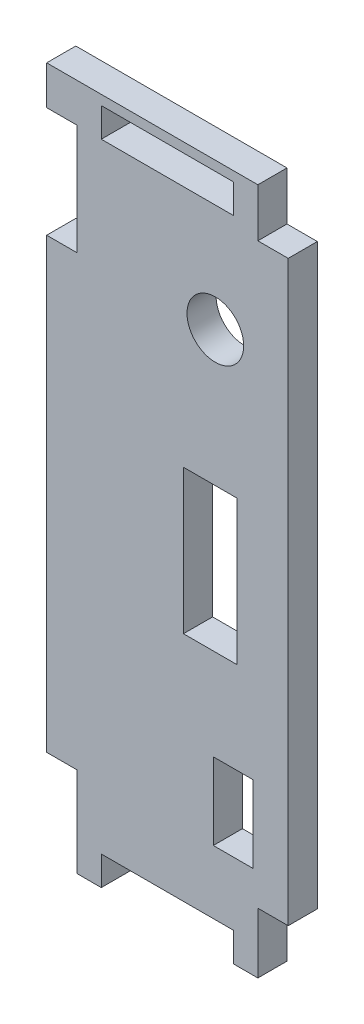
ISO-10303-21;
HEADER;
FILE_DESCRIPTION(('STEP AP214'),'2;1');
FILE_NAME('part.step','',(''),(''),'','','');
FILE_SCHEMA(('AUTOMOTIVE_DESIGN { 1 0 10303 214 1 1 1 1 }'));
ENDSEC;
DATA;
#1=APPLICATION_CONTEXT('core data for automotive mechanical design processes');
#2=APPLICATION_PROTOCOL_DEFINITION('international standard','automotive_design',2000,#1);
#3=PRODUCT_CONTEXT('',#1,'mechanical');
#4=PRODUCT('Part','Part','',(#3));
#5=PRODUCT_RELATED_PRODUCT_CATEGORY('part','',(#4));
#6=PRODUCT_DEFINITION_FORMATION('','',#4);
#7=PRODUCT_DEFINITION_CONTEXT('part definition',#1,'design');
#8=PRODUCT_DEFINITION('design','',#6,#7);
#9=PRODUCT_DEFINITION_SHAPE('','',#8);
#10=(LENGTH_UNIT() NAMED_UNIT(*) SI_UNIT(.MILLI.,.METRE.));
#11=(NAMED_UNIT(*) PLANE_ANGLE_UNIT() SI_UNIT($,.RADIAN.));
#12=(NAMED_UNIT(*) SI_UNIT($,.STERADIAN.) SOLID_ANGLE_UNIT());
#13=UNCERTAINTY_MEASURE_WITH_UNIT(LENGTH_MEASURE(1.E-05),#10,'distance_accuracy_value','');
#14=(GEOMETRIC_REPRESENTATION_CONTEXT(3) GLOBAL_UNCERTAINTY_ASSIGNED_CONTEXT((#13)) GLOBAL_UNIT_ASSIGNED_CONTEXT((#10,
#11,#12)) REPRESENTATION_CONTEXT('',''));
#15=CARTESIAN_POINT('',(0.,0.,0.));
#16=DIRECTION('',(0.,0.,1.));
#17=DIRECTION('',(1.,0.,0.));
#18=AXIS2_PLACEMENT_3D('',#15,#16,#17);
#19=CARTESIAN_POINT('',(19.558,0.,3.048));
#20=DIRECTION('',(-1.,0.,0.));
#21=DIRECTION('',(0.,0.,1.));
#22=AXIS2_PLACEMENT_3D('',#19,#20,#21);
#23=PLANE('',#22);
#24=DIRECTION('',(0.,1.,0.));
#25=VECTOR('',#24,1.);
#26=CARTESIAN_POINT('',(19.558,0.,0.));
#27=LINE('',#26,#25);
#28=CARTESIAN_POINT('',(19.558,64.77,0.));
#29=VERTEX_POINT('',#28);
#30=CARTESIAN_POINT('',(19.558,67.818,0.));
#31=VERTEX_POINT('',#30);
#32=EDGE_CURVE('E336',#29,#31,#27,.T.);
#33=ORIENTED_EDGE('',*,*,#32,.F.);
#34=DIRECTION('',(0.,0.,-1.));
#35=VECTOR('',#34,1.);
#36=CARTESIAN_POINT('',(19.558,64.77,3.048));
#37=LINE('',#36,#35);
#38=CARTESIAN_POINT('',(19.558,64.77,3.048));
#39=VERTEX_POINT('',#38);
#40=EDGE_CURVE('E11',#39,#29,#37,.T.);
#41=ORIENTED_EDGE('',*,*,#40,.F.);
#42=DIRECTION('',(0.,1.,0.));
#43=VECTOR('',#42,1.);
#44=CARTESIAN_POINT('',(19.558,0.,3.048));
#45=LINE('',#44,#43);
#46=CARTESIAN_POINT('',(19.558,67.818,3.048));
#47=VERTEX_POINT('',#46);
#48=EDGE_CURVE('E258',#39,#47,#45,.T.);
#49=ORIENTED_EDGE('',*,*,#48,.T.);
#50=DIRECTION('',(0.,0.,-1.));
#51=VECTOR('',#50,1.);
#52=CARTESIAN_POINT('',(19.558,67.818,3.048));
#53=LINE('',#52,#51);
#54=EDGE_CURVE('E153',#47,#31,#53,.T.);
#55=ORIENTED_EDGE('',*,*,#54,.T.);
#56=EDGE_LOOP('',(#33,#41,#49,#55));
#57=FACE_BOUND('',#56,.T.);
#58=ADVANCED_FACE('F33',(#57),#23,.T.);
#59=CARTESIAN_POINT('',(0.,64.77,3.048));
#60=DIRECTION('',(0.,1.,0.));
#61=DIRECTION('',(0.,0.,1.));
#62=AXIS2_PLACEMENT_3D('',#59,#60,#61);
#63=PLANE('',#62);
#64=DIRECTION('',(1.,0.,0.));
#65=VECTOR('',#64,1.);
#66=CARTESIAN_POINT('',(0.,64.77,0.));
#67=LINE('',#66,#65);
#68=CARTESIAN_POINT('',(5.71499999999999,64.77,0.));
#69=VERTEX_POINT('',#68);
#70=EDGE_CURVE('E248',#69,#29,#67,.T.);
#71=ORIENTED_EDGE('',*,*,#70,.F.);
#72=DIRECTION('',(0.,0.,-1.));
#73=VECTOR('',#72,1.);
#74=CARTESIAN_POINT('',(5.71499999999999,64.77,3.048));
#75=LINE('',#74,#73);
#76=CARTESIAN_POINT('',(5.71499999999999,64.77,3.048));
#77=VERTEX_POINT('',#76);
#78=EDGE_CURVE('E43',#77,#69,#75,.T.);
#79=ORIENTED_EDGE('',*,*,#78,.F.);
#80=DIRECTION('',(1.,0.,0.));
#81=VECTOR('',#80,1.);
#82=CARTESIAN_POINT('',(0.,64.77,3.048));
#83=LINE('',#82,#81);
#84=EDGE_CURVE('E246',#77,#39,#83,.T.);
#85=ORIENTED_EDGE('',*,*,#84,.T.);
#86=ORIENTED_EDGE('',*,*,#40,.T.);
#87=EDGE_LOOP('',(#71,#79,#85,#86));
#88=FACE_BOUND('',#87,.T.);
#89=ADVANCED_FACE('F244',(#88),#63,.T.);
#90=CARTESIAN_POINT('',(5.71499999999983,0.,3.048));
#91=DIRECTION('',(-1.,0.,0.));
#92=DIRECTION('',(0.,-1.,0.));
#93=AXIS2_PLACEMENT_3D('',#90,#91,#92);
#94=PLANE('',#93);
#95=DIRECTION('',(0.,1.,0.));
#96=VECTOR('',#95,1.);
#97=CARTESIAN_POINT('',(5.71499999999983,0.,0.));
#98=LINE('',#97,#96);
#99=CARTESIAN_POINT('',(5.715,67.818,0.));
#100=VERTEX_POINT('',#99);
#101=EDGE_CURVE('E339',#69,#100,#98,.T.);
#102=ORIENTED_EDGE('',*,*,#101,.T.);
#103=DIRECTION('',(0.,0.,-1.));
#104=VECTOR('',#103,1.);
#105=CARTESIAN_POINT('',(5.715,67.818,3.048));
#106=LINE('',#105,#104);
#107=CARTESIAN_POINT('',(5.715,67.818,3.048));
#108=VERTEX_POINT('',#107);
#109=EDGE_CURVE('E251',#108,#100,#106,.T.);
#110=ORIENTED_EDGE('',*,*,#109,.F.);
#111=DIRECTION('',(0.,1.,0.));
#112=VECTOR('',#111,1.);
#113=CARTESIAN_POINT('',(5.71499999999983,0.,3.048));
#114=LINE('',#113,#112);
#115=EDGE_CURVE('E254',#77,#108,#114,.T.);
#116=ORIENTED_EDGE('',*,*,#115,.F.);
#117=ORIENTED_EDGE('',*,*,#78,.T.);
#118=EDGE_LOOP('',(#102,#110,#116,#117));
#119=FACE_BOUND('',#118,.T.);
#120=ADVANCED_FACE('F255',(#119),#94,.F.);
#121=CARTESIAN_POINT('',(0.,6.62939999999999,3.048));
#122=DIRECTION('',(0.,1.,0.));
#123=DIRECTION('',(0.,0.,1.));
#124=AXIS2_PLACEMENT_3D('',#121,#122,#123);
#125=PLANE('',#124);
#126=DIRECTION('',(1.,0.,0.));
#127=VECTOR('',#126,1.);
#128=CARTESIAN_POINT('',(0.,6.62939999999999,0.));
#129=LINE('',#128,#127);
#130=CARTESIAN_POINT('',(17.4370999999999,6.62939999999999,0.));
#131=VERTEX_POINT('',#130);
#132=CARTESIAN_POINT('',(21.6153999999999,6.62939999999999,0.));
#133=VERTEX_POINT('',#132);
#134=EDGE_CURVE('E324',#131,#133,#129,.T.);
#135=ORIENTED_EDGE('',*,*,#134,.F.);
#136=DIRECTION('',(0.,0.,-1.));
#137=VECTOR('',#136,1.);
#138=CARTESIAN_POINT('',(17.4370999999999,6.62939999999999,3.048));
#139=LINE('',#138,#137);
#140=CARTESIAN_POINT('',(17.4370999999999,6.62939999999999,3.048));
#141=VERTEX_POINT('',#140);
#142=EDGE_CURVE('E344',#141,#131,#139,.T.);
#143=ORIENTED_EDGE('',*,*,#142,.F.);
#144=DIRECTION('',(1.,0.,0.));
#145=VECTOR('',#144,1.);
#146=CARTESIAN_POINT('',(0.,6.62939999999999,3.048));
#147=LINE('',#146,#145);
#148=CARTESIAN_POINT('',(21.6153999999999,6.62939999999999,3.048));
#149=VERTEX_POINT('',#148);
#150=EDGE_CURVE('E480',#141,#149,#147,.T.);
#151=ORIENTED_EDGE('',*,*,#150,.T.);
#152=DIRECTION('',(0.,0.,-1.));
#153=VECTOR('',#152,1.);
#154=CARTESIAN_POINT('',(21.6153999999999,6.62939999999999,3.048));
#155=LINE('',#154,#153);
#156=EDGE_CURVE('E346',#149,#133,#155,.T.);
#157=ORIENTED_EDGE('',*,*,#156,.T.);
#158=EDGE_LOOP('',(#135,#143,#151,#157));
#159=FACE_BOUND('',#158,.T.);
#160=ADVANCED_FACE('F503',(#159),#125,.T.);
#161=CARTESIAN_POINT('',(17.4370999999999,0.,3.048));
#162=DIRECTION('',(-1.,0.,0.));
#163=DIRECTION('',(0.,-1.,0.));
#164=AXIS2_PLACEMENT_3D('',#161,#162,#163);
#165=PLANE('',#164);
#166=DIRECTION('',(0.,1.,0.));
#167=VECTOR('',#166,1.);
#168=CARTESIAN_POINT('',(17.4370999999999,0.,0.));
#169=LINE('',#168,#167);
#170=CARTESIAN_POINT('',(17.4370999999999,14.6685,0.));
#171=VERTEX_POINT('',#170);
#172=EDGE_CURVE('E327',#131,#171,#169,.T.);
#173=ORIENTED_EDGE('',*,*,#172,.T.);
#174=DIRECTION('',(0.,0.,-1.));
#175=VECTOR('',#174,1.);
#176=CARTESIAN_POINT('',(17.4370999999999,14.6685,3.048));
#177=LINE('',#176,#175);
#178=CARTESIAN_POINT('',(17.4370999999999,14.6685,3.048));
#179=VERTEX_POINT('',#178);
#180=EDGE_CURVE('E351',#179,#171,#177,.T.);
#181=ORIENTED_EDGE('',*,*,#180,.F.);
#182=DIRECTION('',(0.,1.,0.));
#183=VECTOR('',#182,1.);
#184=CARTESIAN_POINT('',(17.4370999999999,0.,3.048));
#185=LINE('',#184,#183);
#186=EDGE_CURVE('E483',#141,#179,#185,.T.);
#187=ORIENTED_EDGE('',*,*,#186,.F.);
#188=ORIENTED_EDGE('',*,*,#142,.T.);
#189=EDGE_LOOP('',(#173,#181,#187,#188));
#190=FACE_BOUND('',#189,.T.);
#191=ADVANCED_FACE('F505',(#190),#165,.F.);
#192=CARTESIAN_POINT('',(0.,14.6685,3.048));
#193=DIRECTION('',(0.,1.,0.));
#194=DIRECTION('',(-1.,0.,0.));
#195=AXIS2_PLACEMENT_3D('',#192,#193,#194);
#196=PLANE('',#195);
#197=DIRECTION('',(1.,0.,0.));
#198=VECTOR('',#197,1.);
#199=CARTESIAN_POINT('',(0.,14.6685,0.));
#200=LINE('',#199,#198);
#201=CARTESIAN_POINT('',(21.6153999999999,14.6685,0.));
#202=VERTEX_POINT('',#201);
#203=EDGE_CURVE('E330',#171,#202,#200,.T.);
#204=ORIENTED_EDGE('',*,*,#203,.T.);
#205=DIRECTION('',(0.,0.,-1.));
#206=VECTOR('',#205,1.);
#207=CARTESIAN_POINT('',(21.6153999999999,14.6685,3.048));
#208=LINE('',#207,#206);
#209=CARTESIAN_POINT('',(21.6153999999999,14.6685,3.048));
#210=VERTEX_POINT('',#209);
#211=EDGE_CURVE('E348',#210,#202,#208,.T.);
#212=ORIENTED_EDGE('',*,*,#211,.F.);
#213=DIRECTION('',(1.,0.,0.));
#214=VECTOR('',#213,1.);
#215=CARTESIAN_POINT('',(0.,14.6685,3.048));
#216=LINE('',#215,#214);
#217=EDGE_CURVE('E486',#179,#210,#216,.T.);
#218=ORIENTED_EDGE('',*,*,#217,.F.);
#219=ORIENTED_EDGE('',*,*,#180,.T.);
#220=EDGE_LOOP('',(#204,#212,#218,#219));
#221=FACE_BOUND('',#220,.T.);
#222=ADVANCED_FACE('F498',(#221),#196,.F.);
#223=CARTESIAN_POINT('',(1.46568363506623E-13,39.3446000000001,3.048));
#224=DIRECTION('',(0.,-1.,0.));
#225=DIRECTION('',(1.,0.,0.));
#226=AXIS2_PLACEMENT_3D('',#223,#224,#225);
#227=PLANE('',#226);
#228=DIRECTION('',(-1.,0.,0.));
#229=VECTOR('',#228,1.);
#230=CARTESIAN_POINT('',(1.46568363506623E-13,39.3446000000001,0.));
#231=LINE('',#230,#229);
#232=CARTESIAN_POINT('',(19.9009,39.3446,0.));
#233=VERTEX_POINT('',#232);
#234=CARTESIAN_POINT('',(14.3129,39.3446,0.));
#235=VERTEX_POINT('',#234);
#236=EDGE_CURVE('E312',#233,#235,#231,.T.);
#237=ORIENTED_EDGE('',*,*,#236,.F.);
#238=DIRECTION('',(0.,0.,-1.));
#239=VECTOR('',#238,1.);
#240=CARTESIAN_POINT('',(19.9009,39.3446,3.048));
#241=LINE('',#240,#239);
#242=CARTESIAN_POINT('',(19.9009,39.3446,3.048));
#243=VERTEX_POINT('',#242);
#244=EDGE_CURVE('E349',#243,#233,#241,.T.);
#245=ORIENTED_EDGE('',*,*,#244,.F.);
#246=DIRECTION('',(-1.,0.,0.));
#247=VECTOR('',#246,1.);
#248=CARTESIAN_POINT('',(1.46568363506623E-13,39.3446000000001,3.048));
#249=LINE('',#248,#247);
#250=CARTESIAN_POINT('',(14.3129,39.3446,3.048));
#251=VERTEX_POINT('',#250);
#252=EDGE_CURVE('E469',#243,#251,#249,.T.);
#253=ORIENTED_EDGE('',*,*,#252,.T.);
#254=DIRECTION('',(0.,0.,-1.));
#255=VECTOR('',#254,1.);
#256=CARTESIAN_POINT('',(14.3129,39.3446,3.048));
#257=LINE('',#256,#255);
#258=EDGE_CURVE('E355',#251,#235,#257,.T.);
#259=ORIENTED_EDGE('',*,*,#258,.T.);
#260=EDGE_LOOP('',(#237,#245,#253,#259));
#261=FACE_BOUND('',#260,.T.);
#262=ADVANCED_FACE('F512',(#261),#227,.T.);
#263=CARTESIAN_POINT('',(19.9008999999999,0.,3.048));
#264=DIRECTION('',(-1.,0.,0.));
#265=DIRECTION('',(0.,-1.,0.));
#266=AXIS2_PLACEMENT_3D('',#263,#264,#265);
#267=PLANE('',#266);
#268=DIRECTION('',(0.,1.,0.));
#269=VECTOR('',#268,1.);
#270=CARTESIAN_POINT('',(19.9008999999999,0.,0.));
#271=LINE('',#270,#269);
#272=CARTESIAN_POINT('',(19.9009,24.257,0.));
#273=VERTEX_POINT('',#272);
#274=EDGE_CURVE('E315',#273,#233,#271,.T.);
#275=ORIENTED_EDGE('',*,*,#274,.F.);
#276=DIRECTION('',(0.,0.,-1.));
#277=VECTOR('',#276,1.);
#278=CARTESIAN_POINT('',(19.9009,24.257,3.048));
#279=LINE('',#278,#277);
#280=CARTESIAN_POINT('',(19.9009,24.257,3.048));
#281=VERTEX_POINT('',#280);
#282=EDGE_CURVE('E360',#281,#273,#279,.T.);
#283=ORIENTED_EDGE('',*,*,#282,.F.);
#284=DIRECTION('',(0.,1.,0.));
#285=VECTOR('',#284,1.);
#286=CARTESIAN_POINT('',(19.9008999999999,0.,3.048));
#287=LINE('',#286,#285);
#288=EDGE_CURVE('E472',#281,#243,#287,.T.);
#289=ORIENTED_EDGE('',*,*,#288,.T.);
#290=ORIENTED_EDGE('',*,*,#244,.T.);
#291=EDGE_LOOP('',(#275,#283,#289,#290));
#292=FACE_BOUND('',#291,.T.);
#293=ADVANCED_FACE('F600',(#292),#267,.T.);
#294=CARTESIAN_POINT('',(0.,24.257,3.048));
#295=DIRECTION('',(0.,-1.,0.));
#296=DIRECTION('',(1.,0.,0.));
#297=AXIS2_PLACEMENT_3D('',#294,#295,#296);
#298=PLANE('',#297);
#299=DIRECTION('',(-1.,0.,0.));
#300=VECTOR('',#299,1.);
#301=CARTESIAN_POINT('',(0.,24.257,0.));
#302=LINE('',#301,#300);
#303=CARTESIAN_POINT('',(14.3129,24.257,0.));
#304=VERTEX_POINT('',#303);
#305=EDGE_CURVE('E318',#273,#304,#302,.T.);
#306=ORIENTED_EDGE('',*,*,#305,.T.);
#307=DIRECTION('',(0.,0.,-1.));
#308=VECTOR('',#307,1.);
#309=CARTESIAN_POINT('',(14.3129,24.257,3.048));
#310=LINE('',#309,#308);
#311=CARTESIAN_POINT('',(14.3129,24.257,3.048));
#312=VERTEX_POINT('',#311);
#313=EDGE_CURVE('E357',#312,#304,#310,.T.);
#314=ORIENTED_EDGE('',*,*,#313,.F.);
#315=DIRECTION('',(-1.,0.,0.));
#316=VECTOR('',#315,1.);
#317=CARTESIAN_POINT('',(0.,24.257,3.048));
#318=LINE('',#317,#316);
#319=EDGE_CURVE('E475',#281,#312,#318,.T.);
#320=ORIENTED_EDGE('',*,*,#319,.F.);
#321=ORIENTED_EDGE('',*,*,#282,.T.);
#322=EDGE_LOOP('',(#306,#314,#320,#321));
#323=FACE_BOUND('',#322,.T.);
#324=ADVANCED_FACE('F596',(#323),#298,.F.);
#325=CARTESIAN_POINT('',(0.,63.754,3.048));
#326=DIRECTION('',(0.,-1.,0.));
#327=DIRECTION('',(0.,0.,-1.));
#328=AXIS2_PLACEMENT_3D('',#325,#326,#327);
#329=PLANE('',#328);
#330=DIRECTION('',(-1.,0.,0.));
#331=VECTOR('',#330,1.);
#332=CARTESIAN_POINT('',(0.,63.754,0.));
#333=LINE('',#332,#331);
#334=CARTESIAN_POINT('',(25.273,63.754,0.));
#335=VERTEX_POINT('',#334);
#336=CARTESIAN_POINT('',(22.098,63.754,0.));
#337=VERTEX_POINT('',#336);
#338=EDGE_CURVE('E266',#335,#337,#333,.T.);
#339=ORIENTED_EDGE('',*,*,#338,.T.);
#340=DIRECTION('',(0.,0.,-1.));
#341=VECTOR('',#340,1.);
#342=CARTESIAN_POINT('',(22.098,63.754,3.048));
#343=LINE('',#342,#341);
#344=CARTESIAN_POINT('',(22.098,63.754,3.048));
#345=VERTEX_POINT('',#344);
#346=EDGE_CURVE('E37',#345,#337,#343,.T.);
#347=ORIENTED_EDGE('',*,*,#346,.F.);
#348=DIRECTION('',(-1.,0.,0.));
#349=VECTOR('',#348,1.);
#350=CARTESIAN_POINT('',(0.,63.754,3.048));
#351=LINE('',#350,#349);
#352=CARTESIAN_POINT('',(25.273,63.754,3.048));
#353=VERTEX_POINT('',#352);
#354=EDGE_CURVE('E342',#353,#345,#351,.T.);
#355=ORIENTED_EDGE('',*,*,#354,.F.);
#356=DIRECTION('',(0.,0.,-1.));
#357=VECTOR('',#356,1.);
#358=CARTESIAN_POINT('',(25.273,63.754,3.048));
#359=LINE('',#358,#357);
#360=EDGE_CURVE('E265',#353,#335,#359,.T.);
#361=ORIENTED_EDGE('',*,*,#360,.T.);
#362=EDGE_LOOP('',(#339,#347,#355,#361));
#363=FACE_BOUND('',#362,.T.);
#364=ADVANCED_FACE('F35',(#363),#329,.F.);
#365=CARTESIAN_POINT('',(22.098,0.,3.048));
#366=DIRECTION('',(-1.,0.,0.));
#367=DIRECTION('',(0.,0.,1.));
#368=AXIS2_PLACEMENT_3D('',#365,#366,#367);
#369=PLANE('',#368);
#370=DIRECTION('',(0.,1.,0.));
#371=VECTOR('',#370,1.);
#372=CARTESIAN_POINT('',(22.098,0.,0.));
#373=LINE('',#372,#371);
#374=CARTESIAN_POINT('',(22.098,68.834,0.));
#375=VERTEX_POINT('',#374);
#376=EDGE_CURVE('E269',#337,#375,#373,.T.);
#377=ORIENTED_EDGE('',*,*,#376,.T.);
#378=DIRECTION('',(0.,0.,-1.));
#379=VECTOR('',#378,1.);
#380=CARTESIAN_POINT('',(22.098,68.834,3.048));
#381=LINE('',#380,#379);
#382=CARTESIAN_POINT('',(22.098,68.834,3.048));
#383=VERTEX_POINT('',#382);
#384=EDGE_CURVE('E403',#383,#375,#381,.T.);
#385=ORIENTED_EDGE('',*,*,#384,.F.);
#386=DIRECTION('',(0.,1.,0.));
#387=VECTOR('',#386,1.);
#388=CARTESIAN_POINT('',(22.098,0.,3.048));
#389=LINE('',#388,#387);
#390=EDGE_CURVE('E161',#345,#383,#389,.T.);
#391=ORIENTED_EDGE('',*,*,#390,.F.);
#392=ORIENTED_EDGE('',*,*,#346,.T.);
#393=EDGE_LOOP('',(#377,#385,#391,#392));
#394=FACE_BOUND('',#393,.T.);
#395=ADVANCED_FACE('F409',(#394),#369,.F.);
#396=CARTESIAN_POINT('',(0.,68.834,3.048));
#397=DIRECTION('',(0.,-1.,0.));
#398=DIRECTION('',(0.,0.,-1.));
#399=AXIS2_PLACEMENT_3D('',#396,#397,#398);
#400=PLANE('',#399);
#401=DIRECTION('',(-1.,0.,0.));
#402=VECTOR('',#401,1.);
#403=CARTESIAN_POINT('',(0.,68.834,0.));
#404=LINE('',#403,#402);
#405=CARTESIAN_POINT('',(0.,68.834,0.));
#406=VERTEX_POINT('',#405);
#407=EDGE_CURVE('E271',#375,#406,#404,.T.);
#408=ORIENTED_EDGE('',*,*,#407,.T.);
#409=DIRECTION('',(0.,0.,-1.));
#410=VECTOR('',#409,1.);
#411=CARTESIAN_POINT('',(0.,68.834,3.048));
#412=LINE('',#411,#410);
#413=CARTESIAN_POINT('',(0.,68.834,3.048));
#414=VERTEX_POINT('',#413);
#415=EDGE_CURVE('E401',#414,#406,#412,.T.);
#416=ORIENTED_EDGE('',*,*,#415,.F.);
#417=DIRECTION('',(-1.,0.,0.));
#418=VECTOR('',#417,1.);
#419=CARTESIAN_POINT('',(0.,68.834,3.048));
#420=LINE('',#419,#418);
#421=EDGE_CURVE('E431',#383,#414,#420,.T.);
#422=ORIENTED_EDGE('',*,*,#421,.F.);
#423=ORIENTED_EDGE('',*,*,#384,.T.);
#424=EDGE_LOOP('',(#408,#416,#422,#423));
#425=FACE_BOUND('',#424,.T.);
#426=ADVANCED_FACE('F422',(#425),#400,.F.);
#427=CARTESIAN_POINT('',(0.,0.,3.048));
#428=DIRECTION('',(1.,0.,0.));
#429=DIRECTION('',(0.,1.,0.));
#430=AXIS2_PLACEMENT_3D('',#427,#428,#429);
#431=PLANE('',#430);
#432=DIRECTION('',(0.,-1.,0.));
#433=VECTOR('',#432,1.);
#434=CARTESIAN_POINT('',(0.,0.,0.));
#435=LINE('',#434,#433);
#436=CARTESIAN_POINT('',(0.,64.77,0.));
#437=VERTEX_POINT('',#436);
#438=EDGE_CURVE('E273',#406,#437,#435,.T.);
#439=ORIENTED_EDGE('',*,*,#438,.T.);
#440=DIRECTION('',(0.,0.,-1.));
#441=VECTOR('',#440,1.);
#442=CARTESIAN_POINT('',(0.,64.77,3.048));
#443=LINE('',#442,#441);
#444=CARTESIAN_POINT('',(0.,64.77,3.048));
#445=VERTEX_POINT('',#444);
#446=EDGE_CURVE('E398',#445,#437,#443,.T.);
#447=ORIENTED_EDGE('',*,*,#446,.F.);
#448=DIRECTION('',(0.,-1.,0.));
#449=VECTOR('',#448,1.);
#450=CARTESIAN_POINT('',(0.,0.,3.048));
#451=LINE('',#450,#449);
#452=EDGE_CURVE('E427',#414,#445,#451,.T.);
#453=ORIENTED_EDGE('',*,*,#452,.F.);
#454=ORIENTED_EDGE('',*,*,#415,.T.);
#455=EDGE_LOOP('',(#439,#447,#453,#454));
#456=FACE_BOUND('',#455,.T.);
#457=ADVANCED_FACE('F425',(#456),#431,.F.);
#458=CARTESIAN_POINT('',(0.,64.77,3.048));
#459=DIRECTION('',(0.,1.,0.));
#460=DIRECTION('',(0.,0.,1.));
#461=AXIS2_PLACEMENT_3D('',#458,#459,#460);
#462=PLANE('',#461);
#463=DIRECTION('',(1.,0.,0.));
#464=VECTOR('',#463,1.);
#465=CARTESIAN_POINT('',(0.,64.77,0.));
#466=LINE('',#465,#464);
#467=CARTESIAN_POINT('',(3.17499999999999,64.77,0.));
#468=VERTEX_POINT('',#467);
#469=EDGE_CURVE('E275',#437,#468,#466,.T.);
#470=ORIENTED_EDGE('',*,*,#469,.T.);
#471=DIRECTION('',(0.,0.,-1.));
#472=VECTOR('',#471,1.);
#473=CARTESIAN_POINT('',(3.17499999999999,64.77,3.048));
#474=LINE('',#473,#472);
#475=CARTESIAN_POINT('',(3.17499999999999,64.77,3.048));
#476=VERTEX_POINT('',#475);
#477=EDGE_CURVE('E395',#476,#468,#474,.T.);
#478=ORIENTED_EDGE('',*,*,#477,.F.);
#479=DIRECTION('',(1.,0.,0.));
#480=VECTOR('',#479,1.);
#481=CARTESIAN_POINT('',(0.,64.77,3.048));
#482=LINE('',#481,#480);
#483=EDGE_CURVE('E430',#445,#476,#482,.T.);
#484=ORIENTED_EDGE('',*,*,#483,.F.);
#485=ORIENTED_EDGE('',*,*,#446,.T.);
#486=EDGE_LOOP('',(#470,#478,#484,#485));
#487=FACE_BOUND('',#486,.T.);
#488=ADVANCED_FACE('F584',(#487),#462,.F.);
#489=CARTESIAN_POINT('',(3.17500000000003,0.,3.048));
#490=DIRECTION('',(1.,0.,0.));
#491=DIRECTION('',(0.,1.,0.));
#492=AXIS2_PLACEMENT_3D('',#489,#490,#491);
#493=PLANE('',#492);
#494=DIRECTION('',(0.,-1.,0.));
#495=VECTOR('',#494,1.);
#496=CARTESIAN_POINT('',(3.17500000000003,0.,0.));
#497=LINE('',#496,#495);
#498=CARTESIAN_POINT('',(3.175,53.213,0.));
#499=VERTEX_POINT('',#498);
#500=EDGE_CURVE('E277',#468,#499,#497,.T.);
#501=ORIENTED_EDGE('',*,*,#500,.T.);
#502=DIRECTION('',(0.,0.,-1.));
#503=VECTOR('',#502,1.);
#504=CARTESIAN_POINT('',(3.175,53.213,3.048));
#505=LINE('',#504,#503);
#506=CARTESIAN_POINT('',(3.175,53.213,3.048));
#507=VERTEX_POINT('',#506);
#508=EDGE_CURVE('E392',#507,#499,#505,.T.);
#509=ORIENTED_EDGE('',*,*,#508,.F.);
#510=DIRECTION('',(0.,-1.,0.));
#511=VECTOR('',#510,1.);
#512=CARTESIAN_POINT('',(3.17500000000003,0.,3.048));
#513=LINE('',#512,#511);
#514=EDGE_CURVE('E433',#476,#507,#513,.T.);
#515=ORIENTED_EDGE('',*,*,#514,.F.);
#516=ORIENTED_EDGE('',*,*,#477,.T.);
#517=EDGE_LOOP('',(#501,#509,#515,#516));
#518=FACE_BOUND('',#517,.T.);
#519=ADVANCED_FACE('F580',(#518),#493,.F.);
#520=CARTESIAN_POINT('',(0.,53.213,3.048));
#521=DIRECTION('',(0.,-1.,0.));
#522=DIRECTION('',(0.,0.,-1.));
#523=AXIS2_PLACEMENT_3D('',#520,#521,#522);
#524=PLANE('',#523);
#525=DIRECTION('',(-1.,0.,0.));
#526=VECTOR('',#525,1.);
#527=CARTESIAN_POINT('',(0.,53.213,0.));
#528=LINE('',#527,#526);
#529=CARTESIAN_POINT('',(0.,53.213,0.));
#530=VERTEX_POINT('',#529);
#531=EDGE_CURVE('E279',#499,#530,#528,.T.);
#532=ORIENTED_EDGE('',*,*,#531,.T.);
#533=DIRECTION('',(0.,0.,-1.));
#534=VECTOR('',#533,1.);
#535=CARTESIAN_POINT('',(0.,53.213,3.048));
#536=LINE('',#535,#534);
#537=CARTESIAN_POINT('',(0.,53.213,3.048));
#538=VERTEX_POINT('',#537);
#539=EDGE_CURVE('E389',#538,#530,#536,.T.);
#540=ORIENTED_EDGE('',*,*,#539,.F.);
#541=DIRECTION('',(-1.,0.,0.));
#542=VECTOR('',#541,1.);
#543=CARTESIAN_POINT('',(0.,53.213,3.048));
#544=LINE('',#543,#542);
#545=EDGE_CURVE('E439',#507,#538,#544,.T.);
#546=ORIENTED_EDGE('',*,*,#545,.F.);
#547=ORIENTED_EDGE('',*,*,#508,.T.);
#548=EDGE_LOOP('',(#532,#540,#546,#547));
#549=FACE_BOUND('',#548,.T.);
#550=ADVANCED_FACE('F576',(#549),#524,.F.);
#551=CARTESIAN_POINT('',(0.,0.,3.048));
#552=DIRECTION('',(1.,0.,0.));
#553=DIRECTION('',(0.,0.,-1.));
#554=AXIS2_PLACEMENT_3D('',#551,#552,#553);
#555=PLANE('',#554);
#556=DIRECTION('',(0.,-1.,0.));
#557=VECTOR('',#556,1.);
#558=CARTESIAN_POINT('',(0.,0.,0.));
#559=LINE('',#558,#557);
#560=CARTESIAN_POINT('',(0.,6.35,0.));
#561=VERTEX_POINT('',#560);
#562=EDGE_CURVE('E281',#530,#561,#559,.T.);
#563=ORIENTED_EDGE('',*,*,#562,.T.);
#564=DIRECTION('',(0.,0.,-1.));
#565=VECTOR('',#564,1.);
#566=CARTESIAN_POINT('',(0.,6.35,3.048));
#567=LINE('',#566,#565);
#568=CARTESIAN_POINT('',(0.,6.35,3.048));
#569=VERTEX_POINT('',#568);
#570=EDGE_CURVE('E387',#569,#561,#567,.T.);
#571=ORIENTED_EDGE('',*,*,#570,.F.);
#572=DIRECTION('',(0.,-1.,0.));
#573=VECTOR('',#572,1.);
#574=CARTESIAN_POINT('',(0.,0.,3.048));
#575=LINE('',#574,#573);
#576=EDGE_CURVE('E441',#538,#569,#575,.T.);
#577=ORIENTED_EDGE('',*,*,#576,.F.);
#578=ORIENTED_EDGE('',*,*,#539,.T.);
#579=EDGE_LOOP('',(#563,#571,#577,#578));
#580=FACE_BOUND('',#579,.T.);
#581=ADVANCED_FACE('F572',(#580),#555,.F.);
#582=CARTESIAN_POINT('',(0.,6.35,3.048));
#583=DIRECTION('',(0.,-1.,0.));
#584=DIRECTION('',(0.,0.,-1.));
#585=AXIS2_PLACEMENT_3D('',#582,#583,#584);
#586=PLANE('',#585);
#587=DIRECTION('',(-1.,0.,0.));
#588=VECTOR('',#587,1.);
#589=CARTESIAN_POINT('',(0.,6.35,0.));
#590=LINE('',#589,#588);
#591=CARTESIAN_POINT('',(3.175,6.35,0.));
#592=VERTEX_POINT('',#591);
#593=EDGE_CURVE('E284',#592,#561,#590,.T.);
#594=ORIENTED_EDGE('',*,*,#593,.F.);
#595=DIRECTION('',(0.,0.,-1.));
#596=VECTOR('',#595,1.);
#597=CARTESIAN_POINT('',(3.175,6.35,3.048));
#598=LINE('',#597,#596);
#599=CARTESIAN_POINT('',(3.175,6.35,3.048));
#600=VERTEX_POINT('',#599);
#601=EDGE_CURVE('E385',#600,#592,#598,.T.);
#602=ORIENTED_EDGE('',*,*,#601,.F.);
#603=DIRECTION('',(-1.,0.,0.));
#604=VECTOR('',#603,1.);
#605=CARTESIAN_POINT('',(0.,6.35,3.048));
#606=LINE('',#605,#604);
#607=EDGE_CURVE('E443',#600,#569,#606,.T.);
#608=ORIENTED_EDGE('',*,*,#607,.T.);
#609=ORIENTED_EDGE('',*,*,#570,.T.);
#610=EDGE_LOOP('',(#594,#602,#608,#609));
#611=FACE_BOUND('',#610,.T.);
#612=ADVANCED_FACE('F568',(#611),#586,.T.);
#613=CARTESIAN_POINT('',(3.175,0.,3.048));
#614=DIRECTION('',(1.,0.,0.));
#615=DIRECTION('',(0.,0.,-1.));
#616=AXIS2_PLACEMENT_3D('',#613,#614,#615);
#617=PLANE('',#616);
#618=DIRECTION('',(0.,-1.,0.));
#619=VECTOR('',#618,1.);
#620=CARTESIAN_POINT('',(3.175,0.,0.));
#621=LINE('',#620,#619);
#622=CARTESIAN_POINT('',(3.175,-3.048,0.));
#623=VERTEX_POINT('',#622);
#624=EDGE_CURVE('E287',#592,#623,#621,.T.);
#625=ORIENTED_EDGE('',*,*,#624,.T.);
#626=DIRECTION('',(0.,0.,-1.));
#627=VECTOR('',#626,1.);
#628=CARTESIAN_POINT('',(3.175,-3.048,3.048));
#629=LINE('',#628,#627);
#630=CARTESIAN_POINT('',(3.175,-3.048,3.048));
#631=VERTEX_POINT('',#630);
#632=EDGE_CURVE('E383',#631,#623,#629,.T.);
#633=ORIENTED_EDGE('',*,*,#632,.F.);
#634=DIRECTION('',(0.,-1.,0.));
#635=VECTOR('',#634,1.);
#636=CARTESIAN_POINT('',(3.175,0.,3.048));
#637=LINE('',#636,#635);
#638=EDGE_CURVE('E446',#600,#631,#637,.T.);
#639=ORIENTED_EDGE('',*,*,#638,.F.);
#640=ORIENTED_EDGE('',*,*,#601,.T.);
#641=EDGE_LOOP('',(#625,#633,#639,#640));
#642=FACE_BOUND('',#641,.T.);
#643=ADVANCED_FACE('F564',(#642),#617,.F.);
#644=CARTESIAN_POINT('',(0.,-3.048,3.048));
#645=DIRECTION('',(0.,-1.,0.));
#646=DIRECTION('',(1.,0.,0.));
#647=AXIS2_PLACEMENT_3D('',#644,#645,#646);
#648=PLANE('',#647);
#649=DIRECTION('',(-1.,0.,0.));
#650=VECTOR('',#649,1.);
#651=CARTESIAN_POINT('',(0.,-3.048,0.));
#652=LINE('',#651,#650);
#653=CARTESIAN_POINT('',(5.715,-3.048,0.));
#654=VERTEX_POINT('',#653);
#655=EDGE_CURVE('E290',#654,#623,#652,.T.);
#656=ORIENTED_EDGE('',*,*,#655,.F.);
#657=DIRECTION('',(0.,0.,-1.));
#658=VECTOR('',#657,1.);
#659=CARTESIAN_POINT('',(5.715,-3.048,3.048));
#660=LINE('',#659,#658);
#661=CARTESIAN_POINT('',(5.715,-3.048,3.048));
#662=VERTEX_POINT('',#661);
#663=EDGE_CURVE('E381',#662,#654,#660,.T.);
#664=ORIENTED_EDGE('',*,*,#663,.F.);
#665=DIRECTION('',(-1.,0.,0.));
#666=VECTOR('',#665,1.);
#667=CARTESIAN_POINT('',(0.,-3.048,3.048));
#668=LINE('',#667,#666);
#669=EDGE_CURVE('E448',#662,#631,#668,.T.);
#670=ORIENTED_EDGE('',*,*,#669,.T.);
#671=ORIENTED_EDGE('',*,*,#632,.T.);
#672=EDGE_LOOP('',(#656,#664,#670,#671));
#673=FACE_BOUND('',#672,.T.);
#674=ADVANCED_FACE('F560',(#673),#648,.T.);
#675=CARTESIAN_POINT('',(5.715,0.,3.048));
#676=DIRECTION('',(-1.,0.,0.));
#677=DIRECTION('',(0.,0.,1.));
#678=AXIS2_PLACEMENT_3D('',#675,#676,#677);
#679=PLANE('',#678);
#680=DIRECTION('',(0.,1.,0.));
#681=VECTOR('',#680,1.);
#682=CARTESIAN_POINT('',(5.715,0.,0.));
#683=LINE('',#682,#681);
#684=CARTESIAN_POINT('',(5.715,0.,0.));
#685=VERTEX_POINT('',#684);
#686=EDGE_CURVE('E293',#654,#685,#683,.T.);
#687=ORIENTED_EDGE('',*,*,#686,.T.);
#688=DIRECTION('',(0.,0.,-1.));
#689=VECTOR('',#688,1.);
#690=CARTESIAN_POINT('',(5.715,0.,3.048));
#691=LINE('',#690,#689);
#692=CARTESIAN_POINT('',(5.715,0.,3.048));
#693=VERTEX_POINT('',#692);
#694=EDGE_CURVE('E378',#693,#685,#691,.T.);
#695=ORIENTED_EDGE('',*,*,#694,.F.);
#696=DIRECTION('',(0.,1.,0.));
#697=VECTOR('',#696,1.);
#698=CARTESIAN_POINT('',(5.715,0.,3.048));
#699=LINE('',#698,#697);
#700=EDGE_CURVE('E451',#662,#693,#699,.T.);
#701=ORIENTED_EDGE('',*,*,#700,.F.);
#702=ORIENTED_EDGE('',*,*,#663,.T.);
#703=EDGE_LOOP('',(#687,#695,#701,#702));
#704=FACE_BOUND('',#703,.T.);
#705=ADVANCED_FACE('F556',(#704),#679,.F.);
#706=CARTESIAN_POINT('',(0.,0.,3.048));
#707=DIRECTION('',(0.,1.,0.));
#708=DIRECTION('',(0.,0.,1.));
#709=AXIS2_PLACEMENT_3D('',#706,#707,#708);
#710=PLANE('',#709);
#711=DIRECTION('',(1.,0.,0.));
#712=VECTOR('',#711,1.);
#713=CARTESIAN_POINT('',(0.,0.,0.));
#714=LINE('',#713,#712);
#715=CARTESIAN_POINT('',(19.558,0.,0.));
#716=VERTEX_POINT('',#715);
#717=EDGE_CURVE('E295',#685,#716,#714,.T.);
#718=ORIENTED_EDGE('',*,*,#717,.T.);
#719=DIRECTION('',(0.,0.,-1.));
#720=VECTOR('',#719,1.);
#721=CARTESIAN_POINT('',(19.558,0.,3.048));
#722=LINE('',#721,#720);
#723=CARTESIAN_POINT('',(19.558,0.,3.048));
#724=VERTEX_POINT('',#723);
#725=EDGE_CURVE('E375',#724,#716,#722,.T.);
#726=ORIENTED_EDGE('',*,*,#725,.F.);
#727=DIRECTION('',(1.,0.,0.));
#728=VECTOR('',#727,1.);
#729=CARTESIAN_POINT('',(0.,0.,3.048));
#730=LINE('',#729,#728);
#731=EDGE_CURVE('E453',#693,#724,#730,.T.);
#732=ORIENTED_EDGE('',*,*,#731,.F.);
#733=ORIENTED_EDGE('',*,*,#694,.T.);
#734=EDGE_LOOP('',(#718,#726,#732,#733));
#735=FACE_BOUND('',#734,.T.);
#736=ADVANCED_FACE('F552',(#735),#710,.F.);
#737=CARTESIAN_POINT('',(19.558,0.,3.048));
#738=DIRECTION('',(1.,0.,0.));
#739=DIRECTION('',(0.,0.,-1.));
#740=AXIS2_PLACEMENT_3D('',#737,#738,#739);
#741=PLANE('',#740);
#742=DIRECTION('',(0.,-1.,0.));
#743=VECTOR('',#742,1.);
#744=CARTESIAN_POINT('',(19.558,0.,0.));
#745=LINE('',#744,#743);
#746=CARTESIAN_POINT('',(19.558,-3.048,0.));
#747=VERTEX_POINT('',#746);
#748=EDGE_CURVE('E297',#716,#747,#745,.T.);
#749=ORIENTED_EDGE('',*,*,#748,.T.);
#750=DIRECTION('',(0.,0.,-1.));
#751=VECTOR('',#750,1.);
#752=CARTESIAN_POINT('',(19.558,-3.048,3.048));
#753=LINE('',#752,#751);
#754=CARTESIAN_POINT('',(19.558,-3.048,3.048));
#755=VERTEX_POINT('',#754);
#756=EDGE_CURVE('E373',#755,#747,#753,.T.);
#757=ORIENTED_EDGE('',*,*,#756,.F.);
#758=DIRECTION('',(0.,-1.,0.));
#759=VECTOR('',#758,1.);
#760=CARTESIAN_POINT('',(19.558,0.,3.048));
#761=LINE('',#760,#759);
#762=EDGE_CURVE('E455',#724,#755,#761,.T.);
#763=ORIENTED_EDGE('',*,*,#762,.F.);
#764=ORIENTED_EDGE('',*,*,#725,.T.);
#765=EDGE_LOOP('',(#749,#757,#763,#764));
#766=FACE_BOUND('',#765,.T.);
#767=ADVANCED_FACE('F548',(#766),#741,.F.);
#768=CARTESIAN_POINT('',(0.,-3.048,3.048));
#769=DIRECTION('',(0.,-1.,0.));
#770=DIRECTION('',(0.,0.,-1.));
#771=AXIS2_PLACEMENT_3D('',#768,#769,#770);
#772=PLANE('',#771);
#773=DIRECTION('',(-1.,0.,0.));
#774=VECTOR('',#773,1.);
#775=CARTESIAN_POINT('',(0.,-3.048,0.));
#776=LINE('',#775,#774);
#777=CARTESIAN_POINT('',(22.098,-3.048,0.));
#778=VERTEX_POINT('',#777);
#779=EDGE_CURVE('E300',#778,#747,#776,.T.);
#780=ORIENTED_EDGE('',*,*,#779,.F.);
#781=DIRECTION('',(0.,0.,-1.));
#782=VECTOR('',#781,1.);
#783=CARTESIAN_POINT('',(22.098,-3.048,3.048));
#784=LINE('',#783,#782);
#785=CARTESIAN_POINT('',(22.098,-3.048,3.048));
#786=VERTEX_POINT('',#785);
#787=EDGE_CURVE('E371',#786,#778,#784,.T.);
#788=ORIENTED_EDGE('',*,*,#787,.F.);
#789=DIRECTION('',(-1.,0.,0.));
#790=VECTOR('',#789,1.);
#791=CARTESIAN_POINT('',(0.,-3.048,3.048));
#792=LINE('',#791,#790);
#793=EDGE_CURVE('E457',#786,#755,#792,.T.);
#794=ORIENTED_EDGE('',*,*,#793,.T.);
#795=ORIENTED_EDGE('',*,*,#756,.T.);
#796=EDGE_LOOP('',(#780,#788,#794,#795));
#797=FACE_BOUND('',#796,.T.);
#798=ADVANCED_FACE('F539',(#797),#772,.T.);
#799=CARTESIAN_POINT('',(22.098,0.,3.048));
#800=DIRECTION('',(-1.,0.,0.));
#801=DIRECTION('',(0.,0.,1.));
#802=AXIS2_PLACEMENT_3D('',#799,#800,#801);
#803=PLANE('',#802);
#804=DIRECTION('',(0.,1.,0.));
#805=VECTOR('',#804,1.);
#806=CARTESIAN_POINT('',(22.098,0.,0.));
#807=LINE('',#806,#805);
#808=CARTESIAN_POINT('',(22.098,3.27660000000002,0.));
#809=VERTEX_POINT('',#808);
#810=EDGE_CURVE('E303',#778,#809,#807,.T.);
#811=ORIENTED_EDGE('',*,*,#810,.T.);
#812=DIRECTION('',(0.,0.,-1.));
#813=VECTOR('',#812,1.);
#814=CARTESIAN_POINT('',(22.098,3.27660000000002,3.048));
#815=LINE('',#814,#813);
#816=CARTESIAN_POINT('',(22.098,3.27660000000002,3.048));
#817=VERTEX_POINT('',#816);
#818=EDGE_CURVE('E368',#817,#809,#815,.T.);
#819=ORIENTED_EDGE('',*,*,#818,.F.);
#820=DIRECTION('',(0.,1.,0.));
#821=VECTOR('',#820,1.);
#822=CARTESIAN_POINT('',(22.098,0.,3.048));
#823=LINE('',#822,#821);
#824=EDGE_CURVE('E460',#786,#817,#823,.T.);
#825=ORIENTED_EDGE('',*,*,#824,.F.);
#826=ORIENTED_EDGE('',*,*,#787,.T.);
#827=EDGE_LOOP('',(#811,#819,#825,#826));
#828=FACE_BOUND('',#827,.T.);
#829=ADVANCED_FACE('F533',(#828),#803,.F.);
#830=CARTESIAN_POINT('',(0.,3.27660000000001,3.048));
#831=DIRECTION('',(0.,1.,0.));
#832=DIRECTION('',(-1.,0.,0.));
#833=AXIS2_PLACEMENT_3D('',#830,#831,#832);
#834=PLANE('',#833);
#835=DIRECTION('',(1.,0.,0.));
#836=VECTOR('',#835,1.);
#837=CARTESIAN_POINT('',(0.,3.27660000000001,0.));
#838=LINE('',#837,#836);
#839=CARTESIAN_POINT('',(25.273,3.27660000000002,0.));
#840=VERTEX_POINT('',#839);
#841=EDGE_CURVE('E305',#809,#840,#838,.T.);
#842=ORIENTED_EDGE('',*,*,#841,.T.);
#843=DIRECTION('',(0.,0.,-1.));
#844=VECTOR('',#843,1.);
#845=CARTESIAN_POINT('',(25.273,3.27660000000002,3.048));
#846=LINE('',#845,#844);
#847=CARTESIAN_POINT('',(25.273,3.27660000000002,3.048));
#848=VERTEX_POINT('',#847);
#849=EDGE_CURVE('E365',#848,#840,#846,.T.);
#850=ORIENTED_EDGE('',*,*,#849,.F.);
#851=DIRECTION('',(1.,0.,0.));
#852=VECTOR('',#851,1.);
#853=CARTESIAN_POINT('',(0.,3.27660000000001,3.048));
#854=LINE('',#853,#852);
#855=EDGE_CURVE('E462',#817,#848,#854,.T.);
#856=ORIENTED_EDGE('',*,*,#855,.F.);
#857=ORIENTED_EDGE('',*,*,#818,.T.);
#858=EDGE_LOOP('',(#842,#850,#856,#857));
#859=FACE_BOUND('',#858,.T.);
#860=ADVANCED_FACE('F525',(#859),#834,.F.);
#861=CARTESIAN_POINT('',(21.6153999999999,0.,3.048));
#862=DIRECTION('',(-1.,0.,0.));
#863=DIRECTION('',(0.,-1.,0.));
#864=AXIS2_PLACEMENT_3D('',#861,#862,#863);
#865=PLANE('',#864);
#866=DIRECTION('',(0.,1.,0.));
#867=VECTOR('',#866,1.);
#868=CARTESIAN_POINT('',(21.6153999999999,0.,0.));
#869=LINE('',#868,#867);
#870=EDGE_CURVE('E333',#133,#202,#869,.T.);
#871=ORIENTED_EDGE('',*,*,#870,.F.);
#872=ORIENTED_EDGE('',*,*,#156,.F.);
#873=DIRECTION('',(0.,1.,0.));
#874=VECTOR('',#873,1.);
#875=CARTESIAN_POINT('',(21.6153999999999,0.,3.048));
#876=LINE('',#875,#874);
#877=EDGE_CURVE('E260',#149,#210,#876,.T.);
#878=ORIENTED_EDGE('',*,*,#877,.T.);
#879=ORIENTED_EDGE('',*,*,#211,.T.);
#880=EDGE_LOOP('',(#871,#872,#878,#879));
#881=FACE_BOUND('',#880,.T.);
#882=ADVANCED_FACE('F491',(#881),#865,.T.);
#883=CARTESIAN_POINT('',(14.3128999999999,0.,3.048));
#884=DIRECTION('',(-1.,0.,0.));
#885=DIRECTION('',(0.,-1.,0.));
#886=AXIS2_PLACEMENT_3D('',#883,#884,#885);
#887=PLANE('',#886);
#888=DIRECTION('',(0.,1.,0.));
#889=VECTOR('',#888,1.);
#890=CARTESIAN_POINT('',(14.3128999999999,0.,0.));
#891=LINE('',#890,#889);
#892=EDGE_CURVE('E321',#304,#235,#891,.T.);
#893=ORIENTED_EDGE('',*,*,#892,.T.);
#894=ORIENTED_EDGE('',*,*,#258,.F.);
#895=DIRECTION('',(0.,1.,0.));
#896=VECTOR('',#895,1.);
#897=CARTESIAN_POINT('',(14.3128999999999,0.,3.048));
#898=LINE('',#897,#896);
#899=EDGE_CURVE('E478',#312,#251,#898,.T.);
#900=ORIENTED_EDGE('',*,*,#899,.F.);
#901=ORIENTED_EDGE('',*,*,#313,.T.);
#902=EDGE_LOOP('',(#893,#894,#900,#901));
#903=FACE_BOUND('',#902,.T.);
#904=ADVANCED_FACE('F524',(#903),#887,.F.);
#905=CARTESIAN_POINT('',(17.64665,53.48605,3.048));
#906=DIRECTION('',(0.,0.,-1.));
#907=DIRECTION('',(-1.,0.,0.));
#908=AXIS2_PLACEMENT_3D('',#905,#906,#907);
#909=CYLINDRICAL_SURFACE('',#908,2.96545);
#910=CARTESIAN_POINT('',(17.64665,53.48605,3.048));
#911=DIRECTION('',(0.,0.,1.));
#912=DIRECTION('',(1.,0.,0.));
#913=AXIS2_PLACEMENT_3D('',#910,#911,#912);
#914=CIRCLE('',#913,2.96545);
#915=CARTESIAN_POINT('',(20.6121,53.48605,3.048));
#916=VERTEX_POINT('',#915);
#917=EDGE_CURVE('E466',#916,#916,#914,.T.);
#918=ORIENTED_EDGE('',*,*,#917,.T.);
#919=EDGE_LOOP('',(#918));
#920=FACE_BOUND('',#919,.T.);
#921=CARTESIAN_POINT('',(17.64665,53.48605,0.));
#922=DIRECTION('',(0.,0.,1.));
#923=DIRECTION('',(1.,0.,0.));
#924=AXIS2_PLACEMENT_3D('',#921,#922,#923);
#925=CIRCLE('',#924,2.96545);
#926=CARTESIAN_POINT('',(20.6121,53.48605,0.));
#927=VERTEX_POINT('',#926);
#928=EDGE_CURVE('E309',#927,#927,#925,.T.);
#929=ORIENTED_EDGE('',*,*,#928,.F.);
#930=EDGE_LOOP('',(#929));
#931=FACE_BOUND('',#930,.T.);
#932=ADVANCED_FACE('F530',(#920,#931),#909,.F.);
#933=CARTESIAN_POINT('',(25.273,0.,3.048));
#934=DIRECTION('',(-1.,0.,0.));
#935=DIRECTION('',(0.,0.,1.));
#936=AXIS2_PLACEMENT_3D('',#933,#934,#935);
#937=PLANE('',#936);
#938=DIRECTION('',(0.,1.,0.));
#939=VECTOR('',#938,1.);
#940=CARTESIAN_POINT('',(25.273,0.,0.));
#941=LINE('',#940,#939);
#942=EDGE_CURVE('E307',#840,#335,#941,.T.);
#943=ORIENTED_EDGE('',*,*,#942,.T.);
#944=ORIENTED_EDGE('',*,*,#360,.F.);
#945=DIRECTION('',(0.,1.,0.));
#946=VECTOR('',#945,1.);
#947=CARTESIAN_POINT('',(25.273,0.,3.048));
#948=LINE('',#947,#946);
#949=EDGE_CURVE('E464',#848,#353,#948,.T.);
#950=ORIENTED_EDGE('',*,*,#949,.F.);
#951=ORIENTED_EDGE('',*,*,#849,.T.);
#952=EDGE_LOOP('',(#943,#944,#950,#951));
#953=FACE_BOUND('',#952,.T.);
#954=ADVANCED_FACE('F543',(#953),#937,.F.);
#955=CARTESIAN_POINT('',(0.,67.818,3.048));
#956=DIRECTION('',(0.,1.,0.));
#957=DIRECTION('',(0.,0.,1.));
#958=AXIS2_PLACEMENT_3D('',#955,#956,#957);
#959=PLANE('',#958);
#960=DIRECTION('',(1.,0.,0.));
#961=VECTOR('',#960,1.);
#962=CARTESIAN_POINT('',(0.,67.818,0.));
#963=LINE('',#962,#961);
#964=EDGE_CURVE('E146',#100,#31,#963,.T.);
#965=ORIENTED_EDGE('',*,*,#964,.T.);
#966=ORIENTED_EDGE('',*,*,#54,.F.);
#967=DIRECTION('',(1.,0.,0.));
#968=VECTOR('',#967,1.);
#969=CARTESIAN_POINT('',(0.,67.818,3.048));
#970=LINE('',#969,#968);
#971=EDGE_CURVE('E52',#108,#47,#970,.T.);
#972=ORIENTED_EDGE('',*,*,#971,.F.);
#973=ORIENTED_EDGE('',*,*,#109,.T.);
#974=EDGE_LOOP('',(#965,#966,#972,#973));
#975=FACE_BOUND('',#974,.T.);
#976=ADVANCED_FACE('F616',(#975),#959,.F.);
#977=CARTESIAN_POINT('',(0.,0.,3.048));
#978=DIRECTION('',(0.,0.,1.));
#979=DIRECTION('',(1.,0.,0.));
#980=AXIS2_PLACEMENT_3D('',#977,#978,#979);
#981=PLANE('',#980);
#982=ORIENTED_EDGE('',*,*,#354,.T.);
#983=ORIENTED_EDGE('',*,*,#390,.T.);
#984=ORIENTED_EDGE('',*,*,#421,.T.);
#985=ORIENTED_EDGE('',*,*,#452,.T.);
#986=ORIENTED_EDGE('',*,*,#483,.T.);
#987=ORIENTED_EDGE('',*,*,#514,.T.);
#988=ORIENTED_EDGE('',*,*,#545,.T.);
#989=ORIENTED_EDGE('',*,*,#576,.T.);
#990=ORIENTED_EDGE('',*,*,#607,.F.);
#991=ORIENTED_EDGE('',*,*,#638,.T.);
#992=ORIENTED_EDGE('',*,*,#669,.F.);
#993=ORIENTED_EDGE('',*,*,#700,.T.);
#994=ORIENTED_EDGE('',*,*,#731,.T.);
#995=ORIENTED_EDGE('',*,*,#762,.T.);
#996=ORIENTED_EDGE('',*,*,#793,.F.);
#997=ORIENTED_EDGE('',*,*,#824,.T.);
#998=ORIENTED_EDGE('',*,*,#855,.T.);
#999=ORIENTED_EDGE('',*,*,#949,.T.);
#1000=EDGE_LOOP('',(#982,#983,#984,#985,#986,#987,#988,#989,#990,#991,#992,#993,#994,#995,#996,
#997,#998,#999));
#1001=FACE_BOUND('',#1000,.T.);
#1002=ORIENTED_EDGE('',*,*,#917,.F.);
#1003=EDGE_LOOP('',(#1002));
#1004=FACE_BOUND('',#1003,.T.);
#1005=ORIENTED_EDGE('',*,*,#252,.F.);
#1006=ORIENTED_EDGE('',*,*,#288,.F.);
#1007=ORIENTED_EDGE('',*,*,#319,.T.);
#1008=ORIENTED_EDGE('',*,*,#899,.T.);
#1009=EDGE_LOOP('',(#1005,#1006,#1007,#1008));
#1010=FACE_BOUND('',#1009,.T.);
#1011=ORIENTED_EDGE('',*,*,#150,.F.);
#1012=ORIENTED_EDGE('',*,*,#186,.T.);
#1013=ORIENTED_EDGE('',*,*,#217,.T.);
#1014=ORIENTED_EDGE('',*,*,#877,.F.);
#1015=EDGE_LOOP('',(#1011,#1012,#1013,#1014));
#1016=FACE_BOUND('',#1015,.T.);
#1017=ORIENTED_EDGE('',*,*,#48,.F.);
#1018=ORIENTED_EDGE('',*,*,#84,.F.);
#1019=ORIENTED_EDGE('',*,*,#115,.T.);
#1020=ORIENTED_EDGE('',*,*,#971,.T.);
#1021=EDGE_LOOP('',(#1017,#1018,#1019,#1020));
#1022=FACE_BOUND('',#1021,.T.);
#1023=ADVANCED_FACE('F257',(#1001,#1004,#1010,#1016,#1022),#981,.T.);
#1024=CARTESIAN_POINT('',(0.,0.,0.));
#1025=DIRECTION('',(0.,0.,1.));
#1026=DIRECTION('',(1.,0.,0.));
#1027=AXIS2_PLACEMENT_3D('',#1024,#1025,#1026);
#1028=PLANE('',#1027);
#1029=ORIENTED_EDGE('',*,*,#338,.F.);
#1030=ORIENTED_EDGE('',*,*,#942,.F.);
#1031=ORIENTED_EDGE('',*,*,#841,.F.);
#1032=ORIENTED_EDGE('',*,*,#810,.F.);
#1033=ORIENTED_EDGE('',*,*,#779,.T.);
#1034=ORIENTED_EDGE('',*,*,#748,.F.);
#1035=ORIENTED_EDGE('',*,*,#717,.F.);
#1036=ORIENTED_EDGE('',*,*,#686,.F.);
#1037=ORIENTED_EDGE('',*,*,#655,.T.);
#1038=ORIENTED_EDGE('',*,*,#624,.F.);
#1039=ORIENTED_EDGE('',*,*,#593,.T.);
#1040=ORIENTED_EDGE('',*,*,#562,.F.);
#1041=ORIENTED_EDGE('',*,*,#531,.F.);
#1042=ORIENTED_EDGE('',*,*,#500,.F.);
#1043=ORIENTED_EDGE('',*,*,#469,.F.);
#1044=ORIENTED_EDGE('',*,*,#438,.F.);
#1045=ORIENTED_EDGE('',*,*,#407,.F.);
#1046=ORIENTED_EDGE('',*,*,#376,.F.);
#1047=EDGE_LOOP('',(#1029,#1030,#1031,#1032,#1033,#1034,#1035,#1036,#1037,#1038,#1039,#1040,
#1041,#1042,#1043,#1044,#1045,#1046));
#1048=FACE_BOUND('',#1047,.T.);
#1049=ORIENTED_EDGE('',*,*,#928,.T.);
#1050=EDGE_LOOP('',(#1049));
#1051=FACE_BOUND('',#1050,.T.);
#1052=ORIENTED_EDGE('',*,*,#236,.T.);
#1053=ORIENTED_EDGE('',*,*,#892,.F.);
#1054=ORIENTED_EDGE('',*,*,#305,.F.);
#1055=ORIENTED_EDGE('',*,*,#274,.T.);
#1056=EDGE_LOOP('',(#1052,#1053,#1054,#1055));
#1057=FACE_BOUND('',#1056,.T.);
#1058=ORIENTED_EDGE('',*,*,#134,.T.);
#1059=ORIENTED_EDGE('',*,*,#870,.T.);
#1060=ORIENTED_EDGE('',*,*,#203,.F.);
#1061=ORIENTED_EDGE('',*,*,#172,.F.);
#1062=EDGE_LOOP('',(#1058,#1059,#1060,#1061));
#1063=FACE_BOUND('',#1062,.T.);
#1064=ORIENTED_EDGE('',*,*,#32,.T.);
#1065=ORIENTED_EDGE('',*,*,#964,.F.);
#1066=ORIENTED_EDGE('',*,*,#101,.F.);
#1067=ORIENTED_EDGE('',*,*,#70,.T.);
#1068=EDGE_LOOP('',(#1064,#1065,#1066,#1067));
#1069=FACE_BOUND('',#1068,.T.);
#1070=ADVANCED_FACE('F416',(#1048,#1051,#1057,#1063,#1069),#1028,.F.);
#1071=CLOSED_SHELL('',(#58,#89,#120,#160,#191,#222,#262,#293,#324,#364,#395,#426,#457,#488,#519,
#550,#581,#612,#643,#674,#705,#736,#767,#798,#829,#860,#882,#904,#932,#954,#976,#1023,#1070));
#1072=MANIFOLD_SOLID_BREP('B2',#1071);
#1073=ADVANCED_BREP_SHAPE_REPRESENTATION('',(#18,#1072),#14);
#1074=SHAPE_DEFINITION_REPRESENTATION(#9,#1073);
ENDSEC;
END-ISO-10303-21;
